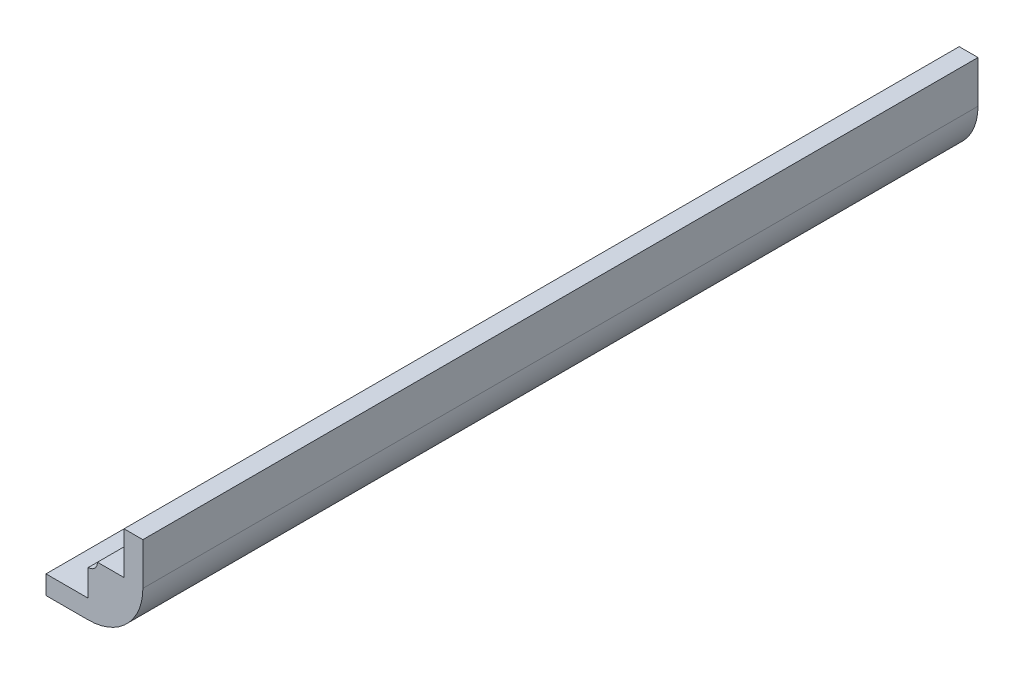
ISO-10303-21;
HEADER;
FILE_DESCRIPTION(('STEP AP214'),'2;1');
FILE_NAME('part.step','',(''),(''),'','','');
FILE_SCHEMA(('AUTOMOTIVE_DESIGN { 1 0 10303 214 1 1 1 1 }'));
ENDSEC;
DATA;
#1=APPLICATION_CONTEXT('core data for automotive mechanical design processes');
#2=APPLICATION_PROTOCOL_DEFINITION('international standard','automotive_design',2000,#1);
#3=PRODUCT_CONTEXT('',#1,'mechanical');
#4=PRODUCT('Part','Part','',(#3));
#5=PRODUCT_RELATED_PRODUCT_CATEGORY('part','',(#4));
#6=PRODUCT_DEFINITION_FORMATION('','',#4);
#7=PRODUCT_DEFINITION_CONTEXT('part definition',#1,'design');
#8=PRODUCT_DEFINITION('design','',#6,#7);
#9=PRODUCT_DEFINITION_SHAPE('','',#8);
#10=(LENGTH_UNIT() NAMED_UNIT(*) SI_UNIT(.MILLI.,.METRE.));
#11=(NAMED_UNIT(*) PLANE_ANGLE_UNIT() SI_UNIT($,.RADIAN.));
#12=(NAMED_UNIT(*) SI_UNIT($,.STERADIAN.) SOLID_ANGLE_UNIT());
#13=UNCERTAINTY_MEASURE_WITH_UNIT(LENGTH_MEASURE(1.E-05),#10,'distance_accuracy_value','');
#14=(GEOMETRIC_REPRESENTATION_CONTEXT(3) GLOBAL_UNCERTAINTY_ASSIGNED_CONTEXT((#13)) GLOBAL_UNIT_ASSIGNED_CONTEXT((#10,
#11,#12)) REPRESENTATION_CONTEXT('',''));
#15=CARTESIAN_POINT('',(0.,0.,0.));
#16=DIRECTION('',(0.,0.,1.));
#17=DIRECTION('',(1.,0.,0.));
#18=AXIS2_PLACEMENT_3D('',#15,#16,#17);
#19=CARTESIAN_POINT('',(-7.3025,-1.500000048,47.09795));
#20=DIRECTION('',(1.,0.,0.));
#21=DIRECTION('',(0.,0.,-1.));
#22=AXIS2_PLACEMENT_3D('',#19,#20,#21);
#23=PLANE('',#22);
#24=DIRECTION('',(0.,-1.,0.));
#25=VECTOR('',#24,1.);
#26=CARTESIAN_POINT('',(-7.3025,-1.500000048,-47.09795));
#27=LINE('',#26,#25);
#28=CARTESIAN_POINT('',(-7.3025,-1.500000048,-47.09795));
#29=VERTEX_POINT('',#28);
#30=CARTESIAN_POINT('',(-7.3025,-3.621225168,-47.09795));
#31=VERTEX_POINT('',#30);
#32=EDGE_CURVE('E91',#29,#31,#27,.T.);
#33=ORIENTED_EDGE('',*,*,#32,.T.);
#34=DIRECTION('',(0.,0.,-1.));
#35=VECTOR('',#34,1.);
#36=CARTESIAN_POINT('',(-7.3025,-3.621225168,47.09795));
#37=LINE('',#36,#35);
#38=CARTESIAN_POINT('',(-7.3025,-3.621225168,47.09795));
#39=VERTEX_POINT('',#38);
#40=EDGE_CURVE('E11',#39,#31,#37,.T.);
#41=ORIENTED_EDGE('',*,*,#40,.F.);
#42=DIRECTION('',(0.,-1.,0.));
#43=VECTOR('',#42,1.);
#44=CARTESIAN_POINT('',(-7.3025,-1.500000048,47.09795));
#45=LINE('',#44,#43);
#46=CARTESIAN_POINT('',(-7.3025,-1.500000048,47.09795));
#47=VERTEX_POINT('',#46);
#48=EDGE_CURVE('E85',#47,#39,#45,.T.);
#49=ORIENTED_EDGE('',*,*,#48,.F.);
#50=DIRECTION('',(0.,0.,-1.));
#51=VECTOR('',#50,1.);
#52=CARTESIAN_POINT('',(-7.3025,-1.500000048,47.09795));
#53=LINE('',#52,#51);
#54=EDGE_CURVE('E79',#47,#29,#53,.T.);
#55=ORIENTED_EDGE('',*,*,#54,.T.);
#56=EDGE_LOOP('',(#33,#41,#49,#55));
#57=FACE_BOUND('',#56,.T.);
#58=ADVANCED_FACE('F39',(#57),#23,.F.);
#59=CARTESIAN_POINT('',(-7.3025,-3.621225168,47.09795));
#60=DIRECTION('',(0.,1.,0.));
#61=DIRECTION('',(0.,0.,1.));
#62=AXIS2_PLACEMENT_3D('',#59,#60,#61);
#63=PLANE('',#62);
#64=DIRECTION('',(1.,0.,0.));
#65=VECTOR('',#64,1.);
#66=CARTESIAN_POINT('',(-7.3025,-3.621225168,-47.09795));
#67=LINE('',#66,#65);
#68=CARTESIAN_POINT('',(-2.54,-3.62122516799999,-47.09795));
#69=VERTEX_POINT('',#68);
#70=EDGE_CURVE('E86',#31,#69,#67,.T.);
#71=ORIENTED_EDGE('',*,*,#70,.T.);
#72=DIRECTION('',(0.,0.,-1.));
#73=VECTOR('',#72,1.);
#74=CARTESIAN_POINT('',(-2.54,-3.621225168,47.09795));
#75=LINE('',#74,#73);
#76=CARTESIAN_POINT('',(-2.54,-3.62122516799999,47.09795));
#77=VERTEX_POINT('',#76);
#78=EDGE_CURVE('E48',#77,#69,#75,.T.);
#79=ORIENTED_EDGE('',*,*,#78,.F.);
#80=DIRECTION('',(1.,0.,0.));
#81=VECTOR('',#80,1.);
#82=CARTESIAN_POINT('',(-7.3025,-3.621225168,47.09795));
#83=LINE('',#82,#81);
#84=EDGE_CURVE('E135',#39,#77,#83,.T.);
#85=ORIENTED_EDGE('',*,*,#84,.F.);
#86=ORIENTED_EDGE('',*,*,#40,.T.);
#87=EDGE_LOOP('',(#71,#79,#85,#86));
#88=FACE_BOUND('',#87,.T.);
#89=ADVANCED_FACE('F134',(#88),#63,.F.);
#90=CARTESIAN_POINT('',(-7.3025,-1.500000048,47.09795));
#91=DIRECTION('',(0.,-1.,0.));
#92=DIRECTION('',(1.,0.,0.));
#93=AXIS2_PLACEMENT_3D('',#90,#91,#92);
#94=PLANE('',#93);
#95=DIRECTION('',(-1.,0.,0.));
#96=VECTOR('',#95,1.);
#97=CARTESIAN_POINT('',(-7.3025,-1.500000048,-47.09795));
#98=LINE('',#97,#96);
#99=CARTESIAN_POINT('',(-2.54,-1.500000048,-47.09795));
#100=VERTEX_POINT('',#99);
#101=EDGE_CURVE('E76',#100,#29,#98,.T.);
#102=ORIENTED_EDGE('',*,*,#101,.T.);
#103=ORIENTED_EDGE('',*,*,#54,.F.);
#104=DIRECTION('',(-1.,0.,0.));
#105=VECTOR('',#104,1.);
#106=CARTESIAN_POINT('',(-7.3025,-1.500000048,47.09795));
#107=LINE('',#106,#105);
#108=CARTESIAN_POINT('',(-2.54,-1.500000048,47.09795));
#109=VERTEX_POINT('',#108);
#110=EDGE_CURVE('E56',#109,#47,#107,.T.);
#111=ORIENTED_EDGE('',*,*,#110,.F.);
#112=DIRECTION('',(0.,0.,-1.));
#113=VECTOR('',#112,1.);
#114=CARTESIAN_POINT('',(-2.54,-1.500000048,47.09795));
#115=LINE('',#114,#113);
#116=EDGE_CURVE('E81',#109,#100,#115,.T.);
#117=ORIENTED_EDGE('',*,*,#116,.T.);
#118=EDGE_LOOP('',(#102,#103,#111,#117));
#119=FACE_BOUND('',#118,.T.);
#120=ADVANCED_FACE('F78',(#119),#94,.F.);
#121=CARTESIAN_POINT('',(0.,0.,47.09795));
#122=DIRECTION('',(0.,0.,1.));
#123=DIRECTION('',(1.,0.,0.));
#124=AXIS2_PLACEMENT_3D('',#121,#122,#123);
#125=PLANE('',#124);
#126=DIRECTION('',(0.,-1.,0.));
#127=VECTOR('',#126,1.);
#128=CARTESIAN_POINT('',(1.50000004799997,7.30250000000001,47.09795));
#129=LINE('',#128,#127);
#130=CARTESIAN_POINT('',(1.50000004799997,7.30250000000001,47.09795));
#131=VERTEX_POINT('',#130);
#132=CARTESIAN_POINT('',(1.50000004799999,2.54000000000001,47.09795));
#133=VERTEX_POINT('',#132);
#134=EDGE_CURVE('E185',#131,#133,#129,.T.);
#135=ORIENTED_EDGE('',*,*,#134,.T.);
#136=DIRECTION('',(-1.,0.,0.));
#137=VECTOR('',#136,1.);
#138=CARTESIAN_POINT('',(1.50000004799999,2.54000000000001,47.09795));
#139=LINE('',#138,#137);
#140=CARTESIAN_POINT('',(-1.50000004800001,2.53999999999999,47.09795));
#141=VERTEX_POINT('',#140);
#142=EDGE_CURVE('E160',#133,#141,#139,.T.);
#143=ORIENTED_EDGE('',*,*,#142,.T.);
#144=CARTESIAN_POINT('',(-2.54,2.53999999999999,47.09795));
#145=DIRECTION('',(0.,0.,-1.));
#146=DIRECTION('',(-1.,0.,0.));
#147=AXIS2_PLACEMENT_3D('',#144,#145,#146);
#148=CIRCLE('',#147,1.03999995199999);
#149=CARTESIAN_POINT('',(-2.54,1.500000048,47.09795));
#150=VERTEX_POINT('',#149);
#151=EDGE_CURVE('E165',#141,#150,#148,.T.);
#152=ORIENTED_EDGE('',*,*,#151,.T.);
#153=DIRECTION('',(0.,-1.,0.));
#154=VECTOR('',#153,1.);
#155=CARTESIAN_POINT('',(-2.54,1.500000048,47.09795));
#156=LINE('',#155,#154);
#157=EDGE_CURVE('E198',#150,#109,#156,.T.);
#158=ORIENTED_EDGE('',*,*,#157,.T.);
#159=ORIENTED_EDGE('',*,*,#110,.T.);
#160=ORIENTED_EDGE('',*,*,#48,.T.);
#161=ORIENTED_EDGE('',*,*,#84,.T.);
#162=CARTESIAN_POINT('',(-2.54,2.53999999999999,47.09795));
#163=DIRECTION('',(0.,0.,1.));
#164=DIRECTION('',(-1.,0.,0.));
#165=AXIS2_PLACEMENT_3D('',#162,#163,#164);
#166=CIRCLE('',#165,6.16122516799998);
#167=CARTESIAN_POINT('',(3.62122516799997,2.54000000000002,47.09795));
#168=VERTEX_POINT('',#167);
#169=EDGE_CURVE('E124',#77,#168,#166,.T.);
#170=ORIENTED_EDGE('',*,*,#169,.T.);
#171=DIRECTION('',(0.,1.,0.));
#172=VECTOR('',#171,1.);
#173=CARTESIAN_POINT('',(3.62122516799997,7.30250000000001,47.09795));
#174=LINE('',#173,#172);
#175=CARTESIAN_POINT('',(3.62122516799997,7.30250000000001,47.09795));
#176=VERTEX_POINT('',#175);
#177=EDGE_CURVE('E192',#168,#176,#174,.T.);
#178=ORIENTED_EDGE('',*,*,#177,.T.);
#179=DIRECTION('',(-1.,0.,0.));
#180=VECTOR('',#179,1.);
#181=CARTESIAN_POINT('',(3.62122516799997,7.30250000000001,47.09795));
#182=LINE('',#181,#180);
#183=EDGE_CURVE('E188',#176,#131,#182,.T.);
#184=ORIENTED_EDGE('',*,*,#183,.T.);
#185=EDGE_LOOP('',(#135,#143,#152,#158,#159,#160,#161,#170,#178,#184));
#186=FACE_BOUND('',#185,.T.);
#187=ADVANCED_FACE('F138',(#186),#125,.T.);
#188=CARTESIAN_POINT('',(0.,0.,-47.09795));
#189=DIRECTION('',(0.,0.,1.));
#190=DIRECTION('',(1.,0.,0.));
#191=AXIS2_PLACEMENT_3D('',#188,#189,#190);
#192=PLANE('',#191);
#193=DIRECTION('',(0.,1.,0.));
#194=VECTOR('',#193,1.);
#195=CARTESIAN_POINT('',(3.62122516799997,7.30250000000001,-47.09795));
#196=LINE('',#195,#194);
#197=CARTESIAN_POINT('',(3.62122516799997,2.54000000000002,-47.09795));
#198=VERTEX_POINT('',#197);
#199=CARTESIAN_POINT('',(3.62122516799997,7.30250000000001,-47.09795));
#200=VERTEX_POINT('',#199);
#201=EDGE_CURVE('E131',#198,#200,#196,.T.);
#202=ORIENTED_EDGE('',*,*,#201,.F.);
#203=CARTESIAN_POINT('',(-2.54,2.53999999999999,-47.09795));
#204=DIRECTION('',(0.,0.,1.));
#205=DIRECTION('',(-1.,0.,0.));
#206=AXIS2_PLACEMENT_3D('',#203,#204,#205);
#207=CIRCLE('',#206,6.16122516799998);
#208=EDGE_CURVE('E120',#69,#198,#207,.T.);
#209=ORIENTED_EDGE('',*,*,#208,.F.);
#210=ORIENTED_EDGE('',*,*,#70,.F.);
#211=ORIENTED_EDGE('',*,*,#32,.F.);
#212=ORIENTED_EDGE('',*,*,#101,.F.);
#213=DIRECTION('',(0.,-1.,0.));
#214=VECTOR('',#213,1.);
#215=CARTESIAN_POINT('',(-2.54,1.500000048,-47.09795));
#216=LINE('',#215,#214);
#217=CARTESIAN_POINT('',(-2.54,1.500000048,-47.09795));
#218=VERTEX_POINT('',#217);
#219=EDGE_CURVE('E71',#218,#100,#216,.T.);
#220=ORIENTED_EDGE('',*,*,#219,.F.);
#221=CARTESIAN_POINT('',(-2.54,2.53999999999999,-47.09795));
#222=DIRECTION('',(0.,0.,-1.));
#223=DIRECTION('',(-1.,0.,0.));
#224=AXIS2_PLACEMENT_3D('',#221,#222,#223);
#225=CIRCLE('',#224,1.03999995199999);
#226=CARTESIAN_POINT('',(-1.50000004800001,2.53999999999999,-47.09795));
#227=VERTEX_POINT('',#226);
#228=EDGE_CURVE('E178',#227,#218,#225,.T.);
#229=ORIENTED_EDGE('',*,*,#228,.F.);
#230=DIRECTION('',(-1.,0.,0.));
#231=VECTOR('',#230,1.);
#232=CARTESIAN_POINT('',(1.50000004799999,2.54000000000001,-47.09795));
#233=LINE('',#232,#231);
#234=CARTESIAN_POINT('',(1.50000004799999,2.54000000000001,-47.09795));
#235=VERTEX_POINT('',#234);
#236=EDGE_CURVE('E161',#235,#227,#233,.T.);
#237=ORIENTED_EDGE('',*,*,#236,.F.);
#238=DIRECTION('',(0.,-1.,0.));
#239=VECTOR('',#238,1.);
#240=CARTESIAN_POINT('',(1.50000004799997,7.30250000000001,-47.09795));
#241=LINE('',#240,#239);
#242=CARTESIAN_POINT('',(1.50000004799997,7.30250000000001,-47.09795));
#243=VERTEX_POINT('',#242);
#244=EDGE_CURVE('E166',#243,#235,#241,.T.);
#245=ORIENTED_EDGE('',*,*,#244,.F.);
#246=DIRECTION('',(-1.,0.,0.));
#247=VECTOR('',#246,1.);
#248=CARTESIAN_POINT('',(3.62122516799997,7.30250000000001,-47.09795));
#249=LINE('',#248,#247);
#250=EDGE_CURVE('E170',#200,#243,#249,.T.);
#251=ORIENTED_EDGE('',*,*,#250,.F.);
#252=EDGE_LOOP('',(#202,#209,#210,#211,#212,#220,#229,#237,#245,#251));
#253=FACE_BOUND('',#252,.T.);
#254=ADVANCED_FACE('F95',(#253),#192,.F.);
#255=CARTESIAN_POINT('',(-2.54,2.53999999999999,47.09795));
#256=DIRECTION('',(0.,0.,-1.));
#257=DIRECTION('',(-1.,0.,0.));
#258=AXIS2_PLACEMENT_3D('',#255,#256,#257);
#259=CYLINDRICAL_SURFACE('',#258,1.03999995199999);
#260=ORIENTED_EDGE('',*,*,#228,.T.);
#261=DIRECTION('',(0.,0.,-1.));
#262=VECTOR('',#261,1.);
#263=CARTESIAN_POINT('',(-2.54,1.500000048,47.09795));
#264=LINE('',#263,#262);
#265=EDGE_CURVE('E99',#150,#218,#264,.T.);
#266=ORIENTED_EDGE('',*,*,#265,.F.);
#267=ORIENTED_EDGE('',*,*,#151,.F.);
#268=DIRECTION('',(0.,0.,-1.));
#269=VECTOR('',#268,1.);
#270=CARTESIAN_POINT('',(-1.50000004800001,2.53999999999999,47.09795));
#271=LINE('',#270,#269);
#272=EDGE_CURVE('E156',#141,#227,#271,.T.);
#273=ORIENTED_EDGE('',*,*,#272,.T.);
#274=EDGE_LOOP('',(#260,#266,#267,#273));
#275=FACE_BOUND('',#274,.T.);
#276=ADVANCED_FACE('F213',(#275),#259,.F.);
#277=CARTESIAN_POINT('',(-2.54,1.500000048,47.09795));
#278=DIRECTION('',(1.,0.,0.));
#279=DIRECTION('',(0.,0.,-1.));
#280=AXIS2_PLACEMENT_3D('',#277,#278,#279);
#281=PLANE('',#280);
#282=ORIENTED_EDGE('',*,*,#219,.T.);
#283=ORIENTED_EDGE('',*,*,#116,.F.);
#284=ORIENTED_EDGE('',*,*,#157,.F.);
#285=ORIENTED_EDGE('',*,*,#265,.T.);
#286=EDGE_LOOP('',(#282,#283,#284,#285));
#287=FACE_BOUND('',#286,.T.);
#288=ADVANCED_FACE('F215',(#287),#281,.F.);
#289=CARTESIAN_POINT('',(-2.54,2.53999999999999,47.09795));
#290=DIRECTION('',(0.,0.,-1.));
#291=DIRECTION('',(-1.,0.,0.));
#292=AXIS2_PLACEMENT_3D('',#289,#290,#291);
#293=CYLINDRICAL_SURFACE('',#292,6.16122516799998);
#294=ORIENTED_EDGE('',*,*,#208,.T.);
#295=DIRECTION('',(0.,0.,-1.));
#296=VECTOR('',#295,1.);
#297=CARTESIAN_POINT('',(3.62122516799997,2.54000000000002,47.09795));
#298=LINE('',#297,#296);
#299=EDGE_CURVE('E104',#168,#198,#298,.T.);
#300=ORIENTED_EDGE('',*,*,#299,.F.);
#301=ORIENTED_EDGE('',*,*,#169,.F.);
#302=ORIENTED_EDGE('',*,*,#78,.T.);
#303=EDGE_LOOP('',(#294,#300,#301,#302));
#304=FACE_BOUND('',#303,.T.);
#305=ADVANCED_FACE('F117',(#304),#293,.T.);
#306=CARTESIAN_POINT('',(3.62122516799997,7.30250000000001,47.09795));
#307=DIRECTION('',(-1.,0.,0.));
#308=DIRECTION('',(0.,0.,1.));
#309=AXIS2_PLACEMENT_3D('',#306,#307,#308);
#310=PLANE('',#309);
#311=ORIENTED_EDGE('',*,*,#201,.T.);
#312=DIRECTION('',(0.,0.,-1.));
#313=VECTOR('',#312,1.);
#314=CARTESIAN_POINT('',(3.62122516799997,7.30250000000001,47.09795));
#315=LINE('',#314,#313);
#316=EDGE_CURVE('E144',#176,#200,#315,.T.);
#317=ORIENTED_EDGE('',*,*,#316,.F.);
#318=ORIENTED_EDGE('',*,*,#177,.F.);
#319=ORIENTED_EDGE('',*,*,#299,.T.);
#320=EDGE_LOOP('',(#311,#317,#318,#319));
#321=FACE_BOUND('',#320,.T.);
#322=ADVANCED_FACE('F250',(#321),#310,.F.);
#323=CARTESIAN_POINT('',(3.62122516799997,7.30250000000001,47.09795));
#324=DIRECTION('',(0.,-1.,0.));
#325=DIRECTION('',(1.,0.,0.));
#326=AXIS2_PLACEMENT_3D('',#323,#324,#325);
#327=PLANE('',#326);
#328=ORIENTED_EDGE('',*,*,#250,.T.);
#329=DIRECTION('',(0.,0.,-1.));
#330=VECTOR('',#329,1.);
#331=CARTESIAN_POINT('',(1.50000004799997,7.30250000000001,47.09795));
#332=LINE('',#331,#330);
#333=EDGE_CURVE('E148',#131,#243,#332,.T.);
#334=ORIENTED_EDGE('',*,*,#333,.F.);
#335=ORIENTED_EDGE('',*,*,#183,.F.);
#336=ORIENTED_EDGE('',*,*,#316,.T.);
#337=EDGE_LOOP('',(#328,#334,#335,#336));
#338=FACE_BOUND('',#337,.T.);
#339=ADVANCED_FACE('F239',(#338),#327,.F.);
#340=CARTESIAN_POINT('',(1.50000004799997,7.30250000000001,47.09795));
#341=DIRECTION('',(1.,0.,0.));
#342=DIRECTION('',(0.,1.,0.));
#343=AXIS2_PLACEMENT_3D('',#340,#341,#342);
#344=PLANE('',#343);
#345=ORIENTED_EDGE('',*,*,#244,.T.);
#346=DIRECTION('',(0.,0.,-1.));
#347=VECTOR('',#346,1.);
#348=CARTESIAN_POINT('',(1.50000004799999,2.54000000000001,47.09795));
#349=LINE('',#348,#347);
#350=EDGE_CURVE('E152',#133,#235,#349,.T.);
#351=ORIENTED_EDGE('',*,*,#350,.F.);
#352=ORIENTED_EDGE('',*,*,#134,.F.);
#353=ORIENTED_EDGE('',*,*,#333,.T.);
#354=EDGE_LOOP('',(#345,#351,#352,#353));
#355=FACE_BOUND('',#354,.T.);
#356=ADVANCED_FACE('F232',(#355),#344,.F.);
#357=CARTESIAN_POINT('',(1.50000004799999,2.54000000000001,47.09795));
#358=DIRECTION('',(0.,-1.,0.));
#359=DIRECTION('',(1.,0.,0.));
#360=AXIS2_PLACEMENT_3D('',#357,#358,#359);
#361=PLANE('',#360);
#362=ORIENTED_EDGE('',*,*,#236,.T.);
#363=ORIENTED_EDGE('',*,*,#272,.F.);
#364=ORIENTED_EDGE('',*,*,#142,.F.);
#365=ORIENTED_EDGE('',*,*,#350,.T.);
#366=EDGE_LOOP('',(#362,#363,#364,#365));
#367=FACE_BOUND('',#366,.T.);
#368=ADVANCED_FACE('F228',(#367),#361,.F.);
#369=CLOSED_SHELL('',(#58,#89,#120,#187,#254,#276,#288,#305,#322,#339,#356,#368));
#370=MANIFOLD_SOLID_BREP('B2',#369);
#371=ADVANCED_BREP_SHAPE_REPRESENTATION('',(#18,#370),#14);
#372=SHAPE_DEFINITION_REPRESENTATION(#9,#371);
ENDSEC;
END-ISO-10303-21;
